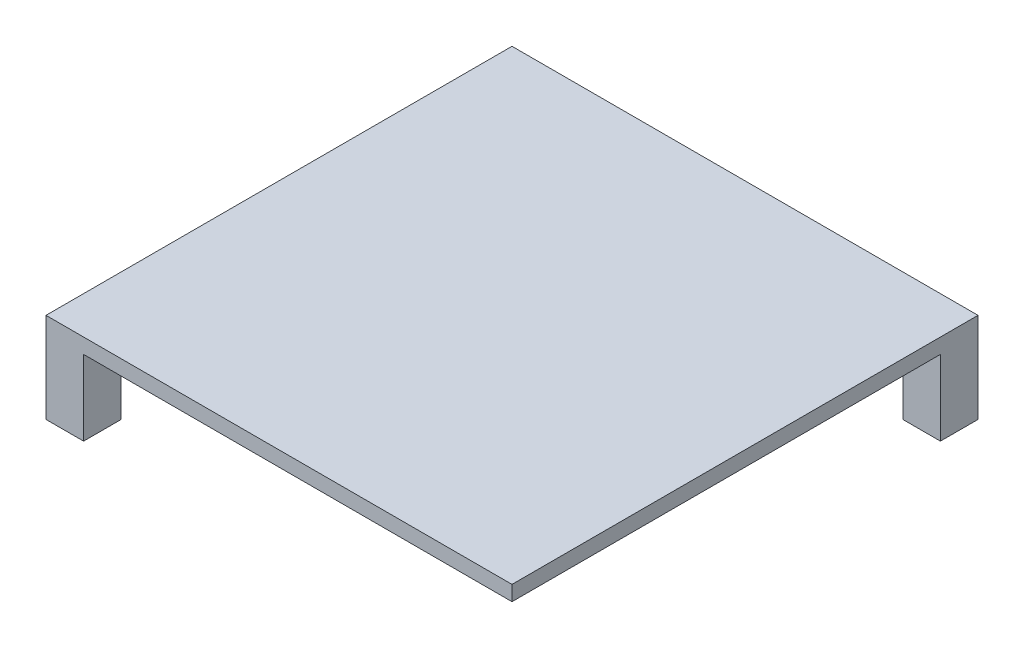
ISO-10303-21;
HEADER;
FILE_DESCRIPTION(('STEP AP214'),'2;1');
FILE_NAME('part.step','',(''),(''),'','','');
FILE_SCHEMA(('AUTOMOTIVE_DESIGN { 1 0 10303 214 1 1 1 1 }'));
ENDSEC;
DATA;
#1=APPLICATION_CONTEXT('core data for automotive mechanical design processes');
#2=APPLICATION_PROTOCOL_DEFINITION('international standard','automotive_design',2000,#1);
#3=PRODUCT_CONTEXT('',#1,'mechanical');
#4=PRODUCT('Part','Part','',(#3));
#5=PRODUCT_RELATED_PRODUCT_CATEGORY('part','',(#4));
#6=PRODUCT_DEFINITION_FORMATION('','',#4);
#7=PRODUCT_DEFINITION_CONTEXT('part definition',#1,'design');
#8=PRODUCT_DEFINITION('design','',#6,#7);
#9=PRODUCT_DEFINITION_SHAPE('','',#8);
#10=(LENGTH_UNIT() NAMED_UNIT(*) SI_UNIT(.MILLI.,.METRE.));
#11=(NAMED_UNIT(*) PLANE_ANGLE_UNIT() SI_UNIT($,.RADIAN.));
#12=(NAMED_UNIT(*) SI_UNIT($,.STERADIAN.) SOLID_ANGLE_UNIT());
#13=UNCERTAINTY_MEASURE_WITH_UNIT(LENGTH_MEASURE(1.E-05),#10,'distance_accuracy_value','');
#14=(GEOMETRIC_REPRESENTATION_CONTEXT(3) GLOBAL_UNCERTAINTY_ASSIGNED_CONTEXT((#13)) GLOBAL_UNIT_ASSIGNED_CONTEXT((#10,
#11,#12)) REPRESENTATION_CONTEXT('',''));
#15=CARTESIAN_POINT('',(0.,0.,0.));
#16=DIRECTION('',(0.,0.,1.));
#17=DIRECTION('',(1.,0.,0.));
#18=AXIS2_PLACEMENT_3D('',#15,#16,#17);
#19=CARTESIAN_POINT('',(0.,0.,0.));
#20=DIRECTION('',(0.,-1.,0.));
#21=DIRECTION('',(0.,0.,-1.));
#22=AXIS2_PLACEMENT_3D('',#19,#20,#21);
#23=PLANE('',#22);
#24=DIRECTION('',(0.,0.,-1.));
#25=VECTOR('',#24,1.);
#26=CARTESIAN_POINT('',(26.,1.80411241501588E-13,-31.));
#27=LINE('',#26,#25);
#28=CARTESIAN_POINT('',(26.,1.80411241501588E-13,-26.));
#29=VERTEX_POINT('',#28);
#30=CARTESIAN_POINT('',(26.,0.,-31.));
#31=VERTEX_POINT('',#30);
#32=EDGE_CURVE('E160',#29,#31,#27,.T.);
#33=ORIENTED_EDGE('',*,*,#32,.F.);
#34=DIRECTION('',(-1.,0.,0.));
#35=VECTOR('',#34,1.);
#36=CARTESIAN_POINT('',(31.,2.15105711021124E-13,-26.));
#37=LINE('',#36,#35);
#38=CARTESIAN_POINT('',(31.,2.15105711021124E-13,-26.));
#39=VERTEX_POINT('',#38);
#40=EDGE_CURVE('E552',#39,#29,#37,.T.);
#41=ORIENTED_EDGE('',*,*,#40,.F.);
#42=DIRECTION('',(0.,0.,-1.));
#43=VECTOR('',#42,1.);
#44=CARTESIAN_POINT('',(31.,0.,31.));
#45=LINE('',#44,#43);
#46=CARTESIAN_POINT('',(31.,0.,31.));
#47=VERTEX_POINT('',#46);
#48=EDGE_CURVE('E165',#47,#39,#45,.T.);
#49=ORIENTED_EDGE('',*,*,#48,.F.);
#50=DIRECTION('',(1.,0.,0.));
#51=VECTOR('',#50,1.);
#52=CARTESIAN_POINT('',(-31.,0.,31.));
#53=LINE('',#52,#51);
#54=CARTESIAN_POINT('',(-26.,0.,31.));
#55=VERTEX_POINT('',#54);
#56=EDGE_CURVE('E249',#55,#47,#53,.T.);
#57=ORIENTED_EDGE('',*,*,#56,.F.);
#58=DIRECTION('',(0.,0.,1.));
#59=VECTOR('',#58,1.);
#60=CARTESIAN_POINT('',(-26.,0.,31.));
#61=LINE('',#60,#59);
#62=CARTESIAN_POINT('',(-26.,0.,26.));
#63=VERTEX_POINT('',#62);
#64=EDGE_CURVE('E216',#63,#55,#61,.T.);
#65=ORIENTED_EDGE('',*,*,#64,.F.);
#66=DIRECTION('',(1.,0.,0.));
#67=VECTOR('',#66,1.);
#68=CARTESIAN_POINT('',(-31.,0.,26.));
#69=LINE('',#68,#67);
#70=CARTESIAN_POINT('',(-31.,0.,26.));
#71=VERTEX_POINT('',#70);
#72=EDGE_CURVE('E207',#71,#63,#69,.T.);
#73=ORIENTED_EDGE('',*,*,#72,.F.);
#74=DIRECTION('',(0.,0.,1.));
#75=VECTOR('',#74,1.);
#76=CARTESIAN_POINT('',(-31.,0.,31.));
#77=LINE('',#76,#75);
#78=CARTESIAN_POINT('',(-31.,0.,-26.0000000000001));
#79=VERTEX_POINT('',#78);
#80=EDGE_CURVE('E264',#79,#71,#77,.T.);
#81=ORIENTED_EDGE('',*,*,#80,.F.);
#82=DIRECTION('',(-1.,0.,0.));
#83=VECTOR('',#82,1.);
#84=CARTESIAN_POINT('',(-30.9999999999999,0.,-26.0000000000001));
#85=LINE('',#84,#83);
#86=CARTESIAN_POINT('',(-25.9999999999999,0.,-26.0000000000001));
#87=VERTEX_POINT('',#86);
#88=EDGE_CURVE('E171',#87,#79,#85,.T.);
#89=ORIENTED_EDGE('',*,*,#88,.F.);
#90=DIRECTION('',(0.,0.,1.));
#91=VECTOR('',#90,1.);
#92=CARTESIAN_POINT('',(-25.9999999999999,0.,-31.0000000000001));
#93=LINE('',#92,#91);
#94=CARTESIAN_POINT('',(-25.9999999999999,0.,-31.0000000000001));
#95=VERTEX_POINT('',#94);
#96=EDGE_CURVE('E167',#95,#87,#93,.T.);
#97=ORIENTED_EDGE('',*,*,#96,.F.);
#98=DIRECTION('',(-1.,0.,0.));
#99=VECTOR('',#98,1.);
#100=CARTESIAN_POINT('',(-31.,0.,-31.));
#101=LINE('',#100,#99);
#102=EDGE_CURVE('E261',#31,#95,#101,.T.);
#103=ORIENTED_EDGE('',*,*,#102,.F.);
#104=EDGE_LOOP('',(#33,#41,#49,#57,#65,#73,#81,#89,#97,#103));
#105=FACE_BOUND('',#104,.T.);
#106=ADVANCED_FACE('F43',(#105),#23,.T.);
#107=CARTESIAN_POINT('',(31.,2.,31.));
#108=DIRECTION('',(-1.,0.,0.));
#109=DIRECTION('',(0.,0.,1.));
#110=AXIS2_PLACEMENT_3D('',#107,#108,#109);
#111=PLANE('',#110);
#112=ORIENTED_EDGE('',*,*,#48,.T.);
#113=DIRECTION('',(0.,1.,0.));
#114=VECTOR('',#113,1.);
#115=CARTESIAN_POINT('',(31.0000000000001,-9.99999999999979,-26.));
#116=LINE('',#115,#114);
#117=CARTESIAN_POINT('',(31.0000000000001,-9.99999999999979,-26.));
#118=VERTEX_POINT('',#117);
#119=EDGE_CURVE('E143',#118,#39,#116,.T.);
#120=ORIENTED_EDGE('',*,*,#119,.F.);
#121=DIRECTION('',(0.,0.,1.));
#122=VECTOR('',#121,1.);
#123=CARTESIAN_POINT('',(31.0000000000001,-9.99999999999979,-31.));
#124=LINE('',#123,#122);
#125=CARTESIAN_POINT('',(31.0000000000001,-9.99999999999979,-31.));
#126=VERTEX_POINT('',#125);
#127=EDGE_CURVE('E151',#126,#118,#124,.T.);
#128=ORIENTED_EDGE('',*,*,#127,.F.);
#129=DIRECTION('',(0.,-1.,0.));
#130=VECTOR('',#129,1.);
#131=CARTESIAN_POINT('',(31.,2.,-31.));
#132=LINE('',#131,#130);
#133=CARTESIAN_POINT('',(31.,2.,-31.));
#134=VERTEX_POINT('',#133);
#135=EDGE_CURVE('E11',#134,#126,#132,.T.);
#136=ORIENTED_EDGE('',*,*,#135,.F.);
#137=DIRECTION('',(0.,0.,-1.));
#138=VECTOR('',#137,1.);
#139=CARTESIAN_POINT('',(31.,2.,31.));
#140=LINE('',#139,#138);
#141=CARTESIAN_POINT('',(31.,2.,31.));
#142=VERTEX_POINT('',#141);
#143=EDGE_CURVE('E244',#142,#134,#140,.T.);
#144=ORIENTED_EDGE('',*,*,#143,.F.);
#145=DIRECTION('',(0.,-1.,0.));
#146=VECTOR('',#145,1.);
#147=CARTESIAN_POINT('',(31.,2.,31.));
#148=LINE('',#147,#146);
#149=EDGE_CURVE('E258',#142,#47,#148,.T.);
#150=ORIENTED_EDGE('',*,*,#149,.T.);
#151=EDGE_LOOP('',(#112,#120,#128,#136,#144,#150));
#152=FACE_BOUND('',#151,.T.);
#153=ADVANCED_FACE('F45',(#152),#111,.F.);
#154=CARTESIAN_POINT('',(-31.,2.,-31.));
#155=DIRECTION('',(0.,0.,1.));
#156=DIRECTION('',(1.,0.,0.));
#157=AXIS2_PLACEMENT_3D('',#154,#155,#156);
#158=PLANE('',#157);
#159=ORIENTED_EDGE('',*,*,#135,.T.);
#160=DIRECTION('',(1.,0.,0.));
#161=VECTOR('',#160,1.);
#162=CARTESIAN_POINT('',(31.0000000000001,-9.99999999999979,-31.));
#163=LINE('',#162,#161);
#164=CARTESIAN_POINT('',(26.0000000000001,-9.99999999999982,-31.));
#165=VERTEX_POINT('',#164);
#166=EDGE_CURVE('E156',#165,#126,#163,.T.);
#167=ORIENTED_EDGE('',*,*,#166,.F.);
#168=DIRECTION('',(0.,1.,0.));
#169=VECTOR('',#168,1.);
#170=CARTESIAN_POINT('',(26.0000000000001,-9.99999999999982,-31.));
#171=LINE('',#170,#169);
#172=EDGE_CURVE('E59',#165,#31,#171,.T.);
#173=ORIENTED_EDGE('',*,*,#172,.T.);
#174=ORIENTED_EDGE('',*,*,#102,.T.);
#175=DIRECTION('',(0.,1.,0.));
#176=VECTOR('',#175,1.);
#177=CARTESIAN_POINT('',(-25.9999999999999,-9.99999999999998,-31.0000000000001));
#178=LINE('',#177,#176);
#179=CARTESIAN_POINT('',(-25.9999999999999,-9.99999999999998,-31.0000000000001));
#180=VERTEX_POINT('',#179);
#181=EDGE_CURVE('E198',#180,#95,#178,.T.);
#182=ORIENTED_EDGE('',*,*,#181,.F.);
#183=DIRECTION('',(1.,0.,0.));
#184=VECTOR('',#183,1.);
#185=CARTESIAN_POINT('',(-30.9999999999999,-10.,-31.0000000000001));
#186=LINE('',#185,#184);
#187=CARTESIAN_POINT('',(-30.9999999999999,-10.,-31.0000000000001));
#188=VERTEX_POINT('',#187);
#189=EDGE_CURVE('E176',#188,#180,#186,.T.);
#190=ORIENTED_EDGE('',*,*,#189,.F.);
#191=DIRECTION('',(0.,-1.,0.));
#192=VECTOR('',#191,1.);
#193=CARTESIAN_POINT('',(-31.,2.,-31.));
#194=LINE('',#193,#192);
#195=CARTESIAN_POINT('',(-31.,2.,-31.));
#196=VERTEX_POINT('',#195);
#197=EDGE_CURVE('E52',#196,#188,#194,.T.);
#198=ORIENTED_EDGE('',*,*,#197,.F.);
#199=DIRECTION('',(-1.,0.,0.));
#200=VECTOR('',#199,1.);
#201=CARTESIAN_POINT('',(-31.,2.,-31.));
#202=LINE('',#201,#200);
#203=EDGE_CURVE('E248',#134,#196,#202,.T.);
#204=ORIENTED_EDGE('',*,*,#203,.F.);
#205=EDGE_LOOP('',(#159,#167,#173,#174,#182,#190,#198,#204));
#206=FACE_BOUND('',#205,.T.);
#207=ADVANCED_FACE('F283',(#206),#158,.F.);
#208=CARTESIAN_POINT('',(-31.,2.,31.));
#209=DIRECTION('',(1.,0.,0.));
#210=DIRECTION('',(0.,0.,-1.));
#211=AXIS2_PLACEMENT_3D('',#208,#209,#210);
#212=PLANE('',#211);
#213=ORIENTED_EDGE('',*,*,#197,.T.);
#214=DIRECTION('',(0.,0.,-1.));
#215=VECTOR('',#214,1.);
#216=CARTESIAN_POINT('',(-30.9999999999999,-10.,-31.0000000000001));
#217=LINE('',#216,#215);
#218=CARTESIAN_POINT('',(-30.9999999999999,-10.,-26.0000000000001));
#219=VERTEX_POINT('',#218);
#220=EDGE_CURVE('E186',#219,#188,#217,.T.);
#221=ORIENTED_EDGE('',*,*,#220,.F.);
#222=DIRECTION('',(0.,1.,0.));
#223=VECTOR('',#222,1.);
#224=CARTESIAN_POINT('',(-30.9999999999999,-10.,-26.0000000000001));
#225=LINE('',#224,#223);
#226=EDGE_CURVE('E67',#219,#79,#225,.T.);
#227=ORIENTED_EDGE('',*,*,#226,.T.);
#228=ORIENTED_EDGE('',*,*,#80,.T.);
#229=DIRECTION('',(0.,1.,0.));
#230=VECTOR('',#229,1.);
#231=CARTESIAN_POINT('',(-31.,-10.,26.));
#232=LINE('',#231,#230);
#233=CARTESIAN_POINT('',(-31.,-10.,26.));
#234=VERTEX_POINT('',#233);
#235=EDGE_CURVE('E240',#234,#71,#232,.T.);
#236=ORIENTED_EDGE('',*,*,#235,.F.);
#237=DIRECTION('',(0.,0.,-1.));
#238=VECTOR('',#237,1.);
#239=CARTESIAN_POINT('',(-31.,-10.,31.));
#240=LINE('',#239,#238);
#241=CARTESIAN_POINT('',(-31.,-10.,31.));
#242=VERTEX_POINT('',#241);
#243=EDGE_CURVE('E211',#242,#234,#240,.T.);
#244=ORIENTED_EDGE('',*,*,#243,.F.);
#245=DIRECTION('',(0.,-1.,0.));
#246=VECTOR('',#245,1.);
#247=CARTESIAN_POINT('',(-31.,2.,31.));
#248=LINE('',#247,#246);
#249=CARTESIAN_POINT('',(-31.,2.,31.));
#250=VERTEX_POINT('',#249);
#251=EDGE_CURVE('E271',#250,#242,#248,.T.);
#252=ORIENTED_EDGE('',*,*,#251,.F.);
#253=DIRECTION('',(0.,0.,1.));
#254=VECTOR('',#253,1.);
#255=CARTESIAN_POINT('',(-31.,2.,31.));
#256=LINE('',#255,#254);
#257=EDGE_CURVE('E252',#196,#250,#256,.T.);
#258=ORIENTED_EDGE('',*,*,#257,.F.);
#259=EDGE_LOOP('',(#213,#221,#227,#228,#236,#244,#252,#258));
#260=FACE_BOUND('',#259,.T.);
#261=ADVANCED_FACE('F276',(#260),#212,.F.);
#262=CARTESIAN_POINT('',(-31.,2.,31.));
#263=DIRECTION('',(0.,0.,-1.));
#264=DIRECTION('',(-1.,0.,0.));
#265=AXIS2_PLACEMENT_3D('',#262,#263,#264);
#266=PLANE('',#265);
#267=ORIENTED_EDGE('',*,*,#251,.T.);
#268=DIRECTION('',(-1.,0.,0.));
#269=VECTOR('',#268,1.);
#270=CARTESIAN_POINT('',(-31.,-10.,31.));
#271=LINE('',#270,#269);
#272=CARTESIAN_POINT('',(-26.,-10.,31.));
#273=VERTEX_POINT('',#272);
#274=EDGE_CURVE('E222',#273,#242,#271,.T.);
#275=ORIENTED_EDGE('',*,*,#274,.F.);
#276=DIRECTION('',(0.,1.,0.));
#277=VECTOR('',#276,1.);
#278=CARTESIAN_POINT('',(-26.,-10.,31.));
#279=LINE('',#278,#277);
#280=EDGE_CURVE('E226',#273,#55,#279,.T.);
#281=ORIENTED_EDGE('',*,*,#280,.T.);
#282=ORIENTED_EDGE('',*,*,#56,.T.);
#283=ORIENTED_EDGE('',*,*,#149,.F.);
#284=DIRECTION('',(1.,0.,0.));
#285=VECTOR('',#284,1.);
#286=CARTESIAN_POINT('',(-31.,2.,31.));
#287=LINE('',#286,#285);
#288=EDGE_CURVE('E255',#250,#142,#287,.T.);
#289=ORIENTED_EDGE('',*,*,#288,.F.);
#290=EDGE_LOOP('',(#267,#275,#281,#282,#283,#289));
#291=FACE_BOUND('',#290,.T.);
#292=ADVANCED_FACE('F315',(#291),#266,.F.);
#293=CARTESIAN_POINT('',(0.,2.,0.));
#294=DIRECTION('',(0.,-1.,0.));
#295=DIRECTION('',(0.,0.,-1.));
#296=AXIS2_PLACEMENT_3D('',#293,#294,#295);
#297=PLANE('',#296);
#298=ORIENTED_EDGE('',*,*,#143,.T.);
#299=ORIENTED_EDGE('',*,*,#203,.T.);
#300=ORIENTED_EDGE('',*,*,#257,.T.);
#301=ORIENTED_EDGE('',*,*,#288,.T.);
#302=EDGE_LOOP('',(#298,#299,#300,#301));
#303=FACE_BOUND('',#302,.T.);
#304=ADVANCED_FACE('F313',(#303),#297,.F.);
#305=CARTESIAN_POINT('',(-31.,-10.,26.));
#306=DIRECTION('',(0.,0.,1.));
#307=DIRECTION('',(1.,0.,0.));
#308=AXIS2_PLACEMENT_3D('',#305,#306,#307);
#309=PLANE('',#308);
#310=ORIENTED_EDGE('',*,*,#72,.T.);
#311=DIRECTION('',(0.,1.,0.));
#312=VECTOR('',#311,1.);
#313=CARTESIAN_POINT('',(-26.,-10.,26.));
#314=LINE('',#313,#312);
#315=CARTESIAN_POINT('',(-26.,-10.,26.));
#316=VERTEX_POINT('',#315);
#317=EDGE_CURVE('E236',#316,#63,#314,.T.);
#318=ORIENTED_EDGE('',*,*,#317,.F.);
#319=DIRECTION('',(1.,0.,0.));
#320=VECTOR('',#319,1.);
#321=CARTESIAN_POINT('',(-31.,-10.,26.));
#322=LINE('',#321,#320);
#323=EDGE_CURVE('E215',#234,#316,#322,.T.);
#324=ORIENTED_EDGE('',*,*,#323,.F.);
#325=ORIENTED_EDGE('',*,*,#235,.T.);
#326=EDGE_LOOP('',(#310,#318,#324,#325));
#327=FACE_BOUND('',#326,.T.);
#328=ADVANCED_FACE('F341',(#327),#309,.F.);
#329=CARTESIAN_POINT('',(-26.,-10.,31.));
#330=DIRECTION('',(-1.,0.,0.));
#331=DIRECTION('',(0.,0.,1.));
#332=AXIS2_PLACEMENT_3D('',#329,#330,#331);
#333=PLANE('',#332);
#334=ORIENTED_EDGE('',*,*,#64,.T.);
#335=ORIENTED_EDGE('',*,*,#280,.F.);
#336=DIRECTION('',(0.,0.,1.));
#337=VECTOR('',#336,1.);
#338=CARTESIAN_POINT('',(-26.,-10.,31.));
#339=LINE('',#338,#337);
#340=EDGE_CURVE('E219',#316,#273,#339,.T.);
#341=ORIENTED_EDGE('',*,*,#340,.F.);
#342=ORIENTED_EDGE('',*,*,#317,.T.);
#343=EDGE_LOOP('',(#334,#335,#341,#342));
#344=FACE_BOUND('',#343,.T.);
#345=ADVANCED_FACE('F347',(#344),#333,.F.);
#346=CARTESIAN_POINT('',(0.,-10.,0.));
#347=DIRECTION('',(0.,-1.,0.));
#348=DIRECTION('',(0.,0.,-1.));
#349=AXIS2_PLACEMENT_3D('',#346,#347,#348);
#350=PLANE('',#349);
#351=CARTESIAN_POINT('',(-28.5,-10.,28.5));
#352=DIRECTION('',(0.,-1.,0.));
#353=DIRECTION('',(0.,0.,-1.));
#354=AXIS2_PLACEMENT_3D('',#351,#352,#353);
#355=CIRCLE('',#354,1.);
#356=CARTESIAN_POINT('',(-28.5,-10.,27.5));
#357=VERTEX_POINT('',#356);
#358=EDGE_CURVE('E202',#357,#357,#355,.T.);
#359=ORIENTED_EDGE('',*,*,#358,.F.);
#360=EDGE_LOOP('',(#359));
#361=FACE_BOUND('',#360,.T.);
#362=ORIENTED_EDGE('',*,*,#243,.T.);
#363=ORIENTED_EDGE('',*,*,#323,.T.);
#364=ORIENTED_EDGE('',*,*,#340,.T.);
#365=ORIENTED_EDGE('',*,*,#274,.T.);
#366=EDGE_LOOP('',(#362,#363,#364,#365));
#367=FACE_BOUND('',#366,.T.);
#368=ADVANCED_FACE('F354',(#361,#367),#350,.T.);
#369=CARTESIAN_POINT('',(-28.5,-7.,28.5));
#370=DIRECTION('',(0.,-1.,0.));
#371=DIRECTION('',(0.,0.,-1.));
#372=AXIS2_PLACEMENT_3D('',#369,#370,#371);
#373=CYLINDRICAL_SURFACE('',#372,1.);
#374=CARTESIAN_POINT('',(-28.5,-7.,28.5));
#375=DIRECTION('',(0.,-1.,0.));
#376=DIRECTION('',(0.,0.,-1.));
#377=AXIS2_PLACEMENT_3D('',#374,#375,#376);
#378=CIRCLE('',#377,1.);
#379=CARTESIAN_POINT('',(-28.5,-7.,27.5));
#380=VERTEX_POINT('',#379);
#381=EDGE_CURVE('E203',#380,#380,#378,.T.);
#382=ORIENTED_EDGE('',*,*,#381,.F.);
#383=EDGE_LOOP('',(#382));
#384=FACE_BOUND('',#383,.T.);
#385=ORIENTED_EDGE('',*,*,#358,.T.);
#386=EDGE_LOOP('',(#385));
#387=FACE_BOUND('',#386,.T.);
#388=ADVANCED_FACE('F362',(#384,#387),#373,.F.);
#389=CARTESIAN_POINT('',(-28.5,-7.,28.5));
#390=DIRECTION('',(0.,-1.,0.));
#391=DIRECTION('',(0.,0.,-1.));
#392=AXIS2_PLACEMENT_3D('',#389,#390,#391);
#393=PLANE('',#392);
#394=ORIENTED_EDGE('',*,*,#381,.T.);
#395=EDGE_LOOP('',(#394));
#396=FACE_BOUND('',#395,.T.);
#397=ADVANCED_FACE('F304',(#396),#393,.T.);
#398=CARTESIAN_POINT('',(-25.9999999999999,-9.99999999999998,-31.0000000000001));
#399=DIRECTION('',(-1.,0.,0.));
#400=DIRECTION('',(0.,0.,1.));
#401=AXIS2_PLACEMENT_3D('',#398,#399,#400);
#402=PLANE('',#401);
#403=ORIENTED_EDGE('',*,*,#96,.T.);
#404=DIRECTION('',(0.,1.,0.));
#405=VECTOR('',#404,1.);
#406=CARTESIAN_POINT('',(-25.9999999999999,-10.,-26.0000000000001));
#407=LINE('',#406,#405);
#408=CARTESIAN_POINT('',(-25.9999999999999,-10.,-26.0000000000001));
#409=VERTEX_POINT('',#408);
#410=EDGE_CURVE('E194',#409,#87,#407,.T.);
#411=ORIENTED_EDGE('',*,*,#410,.F.);
#412=DIRECTION('',(0.,0.,1.));
#413=VECTOR('',#412,1.);
#414=CARTESIAN_POINT('',(-25.9999999999999,-9.99999999999998,-31.0000000000001));
#415=LINE('',#414,#413);
#416=EDGE_CURVE('E180',#180,#409,#415,.T.);
#417=ORIENTED_EDGE('',*,*,#416,.F.);
#418=ORIENTED_EDGE('',*,*,#181,.T.);
#419=EDGE_LOOP('',(#403,#411,#417,#418));
#420=FACE_BOUND('',#419,.T.);
#421=ADVANCED_FACE('F287',(#420),#402,.F.);
#422=CARTESIAN_POINT('',(-30.9999999999999,-10.,-26.0000000000001));
#423=DIRECTION('',(0.,0.,-1.));
#424=DIRECTION('',(-1.,0.,0.));
#425=AXIS2_PLACEMENT_3D('',#422,#423,#424);
#426=PLANE('',#425);
#427=ORIENTED_EDGE('',*,*,#88,.T.);
#428=ORIENTED_EDGE('',*,*,#226,.F.);
#429=DIRECTION('',(-1.,0.,0.));
#430=VECTOR('',#429,1.);
#431=CARTESIAN_POINT('',(-30.9999999999999,-10.,-26.0000000000001));
#432=LINE('',#431,#430);
#433=EDGE_CURVE('E183',#409,#219,#432,.T.);
#434=ORIENTED_EDGE('',*,*,#433,.F.);
#435=ORIENTED_EDGE('',*,*,#410,.T.);
#436=EDGE_LOOP('',(#427,#428,#434,#435));
#437=FACE_BOUND('',#436,.T.);
#438=ADVANCED_FACE('F295',(#437),#426,.F.);
#439=CARTESIAN_POINT('',(0.,-10.,0.));
#440=DIRECTION('',(0.,-1.,0.));
#441=DIRECTION('',(1.,0.,0.));
#442=AXIS2_PLACEMENT_3D('',#439,#440,#441);
#443=PLANE('',#442);
#444=CARTESIAN_POINT('',(-28.4999999999999,-10.,-28.5000000000001));
#445=DIRECTION('',(0.,-1.,0.));
#446=DIRECTION('',(1.,0.,0.));
#447=AXIS2_PLACEMENT_3D('',#444,#445,#446);
#448=CIRCLE('',#447,1.);
#449=CARTESIAN_POINT('',(-27.4999999999999,-10.,-28.5000000000001));
#450=VERTEX_POINT('',#449);
#451=EDGE_CURVE('E553',#450,#450,#448,.T.);
#452=ORIENTED_EDGE('',*,*,#451,.F.);
#453=EDGE_LOOP('',(#452));
#454=FACE_BOUND('',#453,.T.);
#455=ORIENTED_EDGE('',*,*,#189,.T.);
#456=ORIENTED_EDGE('',*,*,#416,.T.);
#457=ORIENTED_EDGE('',*,*,#433,.T.);
#458=ORIENTED_EDGE('',*,*,#220,.T.);
#459=EDGE_LOOP('',(#455,#456,#457,#458));
#460=FACE_BOUND('',#459,.T.);
#461=ADVANCED_FACE('F280',(#454,#460),#443,.T.);
#462=CARTESIAN_POINT('',(31.0000000000001,-9.99999999999979,-26.));
#463=DIRECTION('',(0.,0.,-1.));
#464=DIRECTION('',(-1.,0.,0.));
#465=AXIS2_PLACEMENT_3D('',#462,#463,#464);
#466=PLANE('',#465);
#467=ORIENTED_EDGE('',*,*,#40,.T.);
#468=DIRECTION('',(0.,1.,0.));
#469=VECTOR('',#468,1.);
#470=CARTESIAN_POINT('',(26.0000000000001,-9.99999999999982,-26.));
#471=LINE('',#470,#469);
#472=CARTESIAN_POINT('',(26.0000000000001,-9.99999999999982,-26.));
#473=VERTEX_POINT('',#472);
#474=EDGE_CURVE('E146',#473,#29,#471,.T.);
#475=ORIENTED_EDGE('',*,*,#474,.F.);
#476=DIRECTION('',(-1.,0.,0.));
#477=VECTOR('',#476,1.);
#478=CARTESIAN_POINT('',(31.0000000000001,-9.99999999999979,-26.));
#479=LINE('',#478,#477);
#480=EDGE_CURVE('E139',#118,#473,#479,.T.);
#481=ORIENTED_EDGE('',*,*,#480,.F.);
#482=ORIENTED_EDGE('',*,*,#119,.T.);
#483=EDGE_LOOP('',(#467,#475,#481,#482));
#484=FACE_BOUND('',#483,.T.);
#485=ADVANCED_FACE('F141',(#484),#466,.F.);
#486=CARTESIAN_POINT('',(26.0000000000001,-9.99999999999982,-31.));
#487=DIRECTION('',(1.,0.,0.));
#488=DIRECTION('',(0.,1.,0.));
#489=AXIS2_PLACEMENT_3D('',#486,#487,#488);
#490=PLANE('',#489);
#491=ORIENTED_EDGE('',*,*,#32,.T.);
#492=ORIENTED_EDGE('',*,*,#172,.F.);
#493=DIRECTION('',(0.,0.,-1.));
#494=VECTOR('',#493,1.);
#495=CARTESIAN_POINT('',(26.0000000000001,-9.99999999999982,-31.));
#496=LINE('',#495,#494);
#497=EDGE_CURVE('E150',#473,#165,#496,.T.);
#498=ORIENTED_EDGE('',*,*,#497,.F.);
#499=ORIENTED_EDGE('',*,*,#474,.T.);
#500=EDGE_LOOP('',(#491,#492,#498,#499));
#501=FACE_BOUND('',#500,.T.);
#502=ADVANCED_FACE('F403',(#501),#490,.F.);
#503=CARTESIAN_POINT('',(0.,-10.,0.));
#504=DIRECTION('',(0.,-1.,0.));
#505=DIRECTION('',(0.,0.,1.));
#506=AXIS2_PLACEMENT_3D('',#503,#504,#505);
#507=PLANE('',#506);
#508=CARTESIAN_POINT('',(28.5000000000001,-9.9999999999998,-28.5));
#509=DIRECTION('',(0.,-1.,0.));
#510=DIRECTION('',(0.,0.,1.));
#511=AXIS2_PLACEMENT_3D('',#508,#509,#510);
#512=CIRCLE('',#511,1.);
#513=CARTESIAN_POINT('',(28.5000000000001,-9.9999999999998,-27.5));
#514=VERTEX_POINT('',#513);
#515=EDGE_CURVE('E565',#514,#514,#512,.T.);
#516=ORIENTED_EDGE('',*,*,#515,.F.);
#517=EDGE_LOOP('',(#516));
#518=FACE_BOUND('',#517,.T.);
#519=ORIENTED_EDGE('',*,*,#127,.T.);
#520=ORIENTED_EDGE('',*,*,#480,.T.);
#521=ORIENTED_EDGE('',*,*,#497,.T.);
#522=ORIENTED_EDGE('',*,*,#166,.T.);
#523=EDGE_LOOP('',(#519,#520,#521,#522));
#524=FACE_BOUND('',#523,.T.);
#525=ADVANCED_FACE('F155',(#518,#524),#507,.T.);
#526=CARTESIAN_POINT('',(28.5,-6.9999999999998,-28.5));
#527=DIRECTION('',(0.,-1.,0.));
#528=DIRECTION('',(1.,0.,0.));
#529=AXIS2_PLACEMENT_3D('',#526,#527,#528);
#530=CYLINDRICAL_SURFACE('',#529,1.);
#531=CARTESIAN_POINT('',(28.5,-6.9999999999998,-28.5));
#532=DIRECTION('',(0.,-1.,0.));
#533=DIRECTION('',(0.,0.,1.));
#534=AXIS2_PLACEMENT_3D('',#531,#532,#533);
#535=CIRCLE('',#534,1.);
#536=CARTESIAN_POINT('',(28.5,-6.9999999999998,-27.5));
#537=VERTEX_POINT('',#536);
#538=EDGE_CURVE('E559',#537,#537,#535,.T.);
#539=ORIENTED_EDGE('',*,*,#538,.F.);
#540=EDGE_LOOP('',(#539));
#541=FACE_BOUND('',#540,.T.);
#542=ORIENTED_EDGE('',*,*,#515,.T.);
#543=EDGE_LOOP('',(#542));
#544=FACE_BOUND('',#543,.T.);
#545=ADVANCED_FACE('F423',(#541,#544),#530,.F.);
#546=CARTESIAN_POINT('',(28.5,-6.9999999999998,-28.5));
#547=DIRECTION('',(0.,-1.,0.));
#548=DIRECTION('',(0.,0.,1.));
#549=AXIS2_PLACEMENT_3D('',#546,#547,#548);
#550=PLANE('',#549);
#551=ORIENTED_EDGE('',*,*,#538,.T.);
#552=EDGE_LOOP('',(#551));
#553=FACE_BOUND('',#552,.T.);
#554=ADVANCED_FACE('F434',(#553),#550,.T.);
#555=CARTESIAN_POINT('',(-28.4999999999999,-7.,-28.5000000000001));
#556=DIRECTION('',(0.,-1.,0.));
#557=DIRECTION('',(1.,0.,0.));
#558=AXIS2_PLACEMENT_3D('',#555,#556,#557);
#559=CYLINDRICAL_SURFACE('',#558,1.);
#560=CARTESIAN_POINT('',(-28.4999999999999,-7.,-28.5000000000001));
#561=DIRECTION('',(0.,-1.,0.));
#562=DIRECTION('',(1.,0.,0.));
#563=AXIS2_PLACEMENT_3D('',#560,#561,#562);
#564=CIRCLE('',#563,1.);
#565=CARTESIAN_POINT('',(-27.4999999999999,-7.,-28.5000000000001));
#566=VERTEX_POINT('',#565);
#567=EDGE_CURVE('E550',#566,#566,#564,.T.);
#568=ORIENTED_EDGE('',*,*,#567,.F.);
#569=EDGE_LOOP('',(#568));
#570=FACE_BOUND('',#569,.T.);
#571=ORIENTED_EDGE('',*,*,#451,.T.);
#572=EDGE_LOOP('',(#571));
#573=FACE_BOUND('',#572,.T.);
#574=ADVANCED_FACE('F445',(#570,#573),#559,.F.);
#575=CARTESIAN_POINT('',(-28.4999999999999,-7.,-28.5000000000001));
#576=DIRECTION('',(0.,-1.,0.));
#577=DIRECTION('',(1.,0.,0.));
#578=AXIS2_PLACEMENT_3D('',#575,#576,#577);
#579=PLANE('',#578);
#580=ORIENTED_EDGE('',*,*,#567,.T.);
#581=EDGE_LOOP('',(#580));
#582=FACE_BOUND('',#581,.T.);
#583=ADVANCED_FACE('F456',(#582),#579,.T.);
#584=CLOSED_SHELL('',(#106,#153,#207,#261,#292,#304,#328,#345,#368,#388,#397,#421,#438,#461,
#485,#502,#525,#545,#554,#574,#583));
#585=MANIFOLD_SOLID_BREP('B2',#584);
#586=ADVANCED_BREP_SHAPE_REPRESENTATION('',(#18,#585),#14);
#587=SHAPE_DEFINITION_REPRESENTATION(#9,#586);
ENDSEC;
END-ISO-10303-21;
